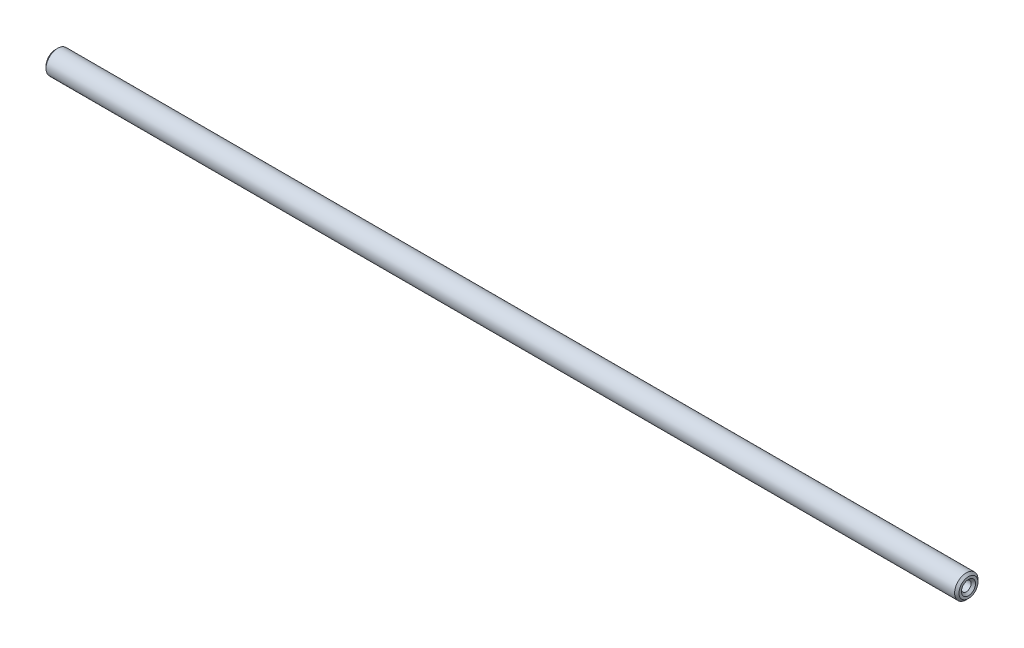
ISO-10303-21;
HEADER;
FILE_DESCRIPTION(('STEP AP214'),'2;1');
FILE_NAME('part.step','',(''),(''),'','','');
FILE_SCHEMA(('AUTOMOTIVE_DESIGN { 1 0 10303 214 1 1 1 1 }'));
ENDSEC;
DATA;
#1=APPLICATION_CONTEXT('core data for automotive mechanical design processes');
#2=APPLICATION_PROTOCOL_DEFINITION('international standard','automotive_design',2000,#1);
#3=PRODUCT_CONTEXT('',#1,'mechanical');
#4=PRODUCT('Part','Part','',(#3));
#5=PRODUCT_RELATED_PRODUCT_CATEGORY('part','',(#4));
#6=PRODUCT_DEFINITION_FORMATION('','',#4);
#7=PRODUCT_DEFINITION_CONTEXT('part definition',#1,'design');
#8=PRODUCT_DEFINITION('design','',#6,#7);
#9=PRODUCT_DEFINITION_SHAPE('','',#8);
#10=(LENGTH_UNIT() NAMED_UNIT(*) SI_UNIT(.MILLI.,.METRE.));
#11=(NAMED_UNIT(*) PLANE_ANGLE_UNIT() SI_UNIT($,.RADIAN.));
#12=(NAMED_UNIT(*) SI_UNIT($,.STERADIAN.) SOLID_ANGLE_UNIT());
#13=UNCERTAINTY_MEASURE_WITH_UNIT(LENGTH_MEASURE(1.E-05),#10,'distance_accuracy_value','');
#14=(GEOMETRIC_REPRESENTATION_CONTEXT(3) GLOBAL_UNCERTAINTY_ASSIGNED_CONTEXT((#13)) GLOBAL_UNIT_ASSIGNED_CONTEXT((#10,
#11,#12)) REPRESENTATION_CONTEXT('',''));
#15=CARTESIAN_POINT('',(0.,0.,0.));
#16=DIRECTION('',(0.,0.,1.));
#17=DIRECTION('',(1.,0.,0.));
#18=AXIS2_PLACEMENT_3D('',#15,#16,#17);
#19=CARTESIAN_POINT('',(156.,0.,0.));
#20=DIRECTION('',(-1.,0.,0.));
#21=DIRECTION('',(0.,0.,1.));
#22=AXIS2_PLACEMENT_3D('',#19,#20,#21);
#23=CYLINDRICAL_SURFACE('',#22,4.);
#24=CARTESIAN_POINT('',(155.25,0.,0.));
#25=DIRECTION('',(1.,0.,0.));
#26=DIRECTION('',(0.,0.,-1.));
#27=AXIS2_PLACEMENT_3D('',#24,#25,#26);
#28=CIRCLE('',#27,4.);
#29=CARTESIAN_POINT('',(155.25,0.,-4.));
#30=VERTEX_POINT('',#29);
#31=EDGE_CURVE('E293',#30,#30,#28,.F.);
#32=ORIENTED_EDGE('',*,*,#31,.T.);
#33=EDGE_LOOP('',(#32));
#34=FACE_BOUND('',#33,.T.);
#35=CARTESIAN_POINT('',(-155.25,0.,0.));
#36=DIRECTION('',(1.,0.,0.));
#37=DIRECTION('',(0.,0.,-1.));
#38=AXIS2_PLACEMENT_3D('',#35,#36,#37);
#39=CIRCLE('',#38,4.);
#40=CARTESIAN_POINT('',(-155.25,0.,-4.));
#41=VERTEX_POINT('',#40);
#42=EDGE_CURVE('E297',#41,#41,#39,.T.);
#43=ORIENTED_EDGE('',*,*,#42,.T.);
#44=EDGE_LOOP('',(#43));
#45=FACE_BOUND('',#44,.T.);
#46=ADVANCED_FACE('F281',(#34,#45),#23,.T.);
#47=CARTESIAN_POINT('',(156.,0.,0.));
#48=DIRECTION('',(1.,0.,0.));
#49=DIRECTION('',(0.,0.,-1.));
#50=AXIS2_PLACEMENT_3D('',#47,#48,#49);
#51=PLANE('',#50);
#52=CARTESIAN_POINT('',(156.,0.,0.));
#53=DIRECTION('',(1.,0.,0.));
#54=DIRECTION('',(0.,0.,-1.));
#55=AXIS2_PLACEMENT_3D('',#52,#53,#54);
#56=CIRCLE('',#55,2.39999999999993);
#57=CARTESIAN_POINT('',(156.,0.,-2.39999999999993));
#58=VERTEX_POINT('',#57);
#59=EDGE_CURVE('E308',#58,#58,#56,.F.);
#60=ORIENTED_EDGE('',*,*,#59,.T.);
#61=EDGE_LOOP('',(#60));
#62=FACE_BOUND('',#61,.T.);
#63=CARTESIAN_POINT('',(156.,0.,0.));
#64=DIRECTION('',(1.,0.,0.));
#65=DIRECTION('',(0.,0.,-1.));
#66=AXIS2_PLACEMENT_3D('',#63,#64,#65);
#67=CIRCLE('',#66,3.24999999999995);
#68=CARTESIAN_POINT('',(156.,0.,-3.24999999999995));
#69=VERTEX_POINT('',#68);
#70=EDGE_CURVE('E311',#69,#69,#67,.T.);
#71=ORIENTED_EDGE('',*,*,#70,.T.);
#72=EDGE_LOOP('',(#71));
#73=FACE_BOUND('',#72,.T.);
#74=ADVANCED_FACE('F315',(#62,#73),#51,.T.);
#75=CARTESIAN_POINT('',(-156.,0.,0.));
#76=DIRECTION('',(1.,0.,0.));
#77=DIRECTION('',(0.,0.,-1.));
#78=AXIS2_PLACEMENT_3D('',#75,#76,#77);
#79=PLANE('',#78);
#80=CARTESIAN_POINT('',(-156.,0.,0.));
#81=DIRECTION('',(1.,0.,0.));
#82=DIRECTION('',(0.,0.,-1.));
#83=AXIS2_PLACEMENT_3D('',#80,#81,#82);
#84=CIRCLE('',#83,2.40000000000004);
#85=CARTESIAN_POINT('',(-156.,0.,-2.40000000000004));
#86=VERTEX_POINT('',#85);
#87=EDGE_CURVE('E11',#86,#86,#84,.T.);
#88=ORIENTED_EDGE('',*,*,#87,.T.);
#89=EDGE_LOOP('',(#88));
#90=FACE_BOUND('',#89,.T.);
#91=CARTESIAN_POINT('',(-156.,0.,0.));
#92=DIRECTION('',(1.,0.,0.));
#93=DIRECTION('',(0.,0.,-1.));
#94=AXIS2_PLACEMENT_3D('',#91,#92,#93);
#95=CIRCLE('',#94,3.25000000000006);
#96=CARTESIAN_POINT('',(-156.,0.,-3.25000000000006));
#97=VERTEX_POINT('',#96);
#98=EDGE_CURVE('E289',#97,#97,#95,.F.);
#99=ORIENTED_EDGE('',*,*,#98,.T.);
#100=EDGE_LOOP('',(#99));
#101=FACE_BOUND('',#100,.T.);
#102=ADVANCED_FACE('F339',(#90,#101),#79,.F.);
#103=CARTESIAN_POINT('',(156.,0.,0.));
#104=DIRECTION('',(-1.,0.,0.));
#105=DIRECTION('',(0.,0.,1.));
#106=AXIS2_PLACEMENT_3D('',#103,#104,#105);
#107=CYLINDRICAL_SURFACE('',#106,1.65);
#108=CARTESIAN_POINT('',(155.25,0.,0.));
#109=DIRECTION('',(1.,0.,0.));
#110=DIRECTION('',(0.,0.,-1.));
#111=AXIS2_PLACEMENT_3D('',#108,#109,#110);
#112=CIRCLE('',#111,1.65);
#113=CARTESIAN_POINT('',(155.25,0.,-1.65));
#114=VERTEX_POINT('',#113);
#115=EDGE_CURVE('E302',#114,#114,#112,.T.);
#116=ORIENTED_EDGE('',*,*,#115,.T.);
#117=EDGE_LOOP('',(#116));
#118=FACE_BOUND('',#117,.T.);
#119=CARTESIAN_POINT('',(-155.25,0.,0.));
#120=DIRECTION('',(1.,0.,0.));
#121=DIRECTION('',(0.,0.,-1.));
#122=AXIS2_PLACEMENT_3D('',#119,#120,#121);
#123=CIRCLE('',#122,1.65);
#124=CARTESIAN_POINT('',(-155.25,0.,-1.65));
#125=VERTEX_POINT('',#124);
#126=EDGE_CURVE('E305',#125,#125,#123,.F.);
#127=ORIENTED_EDGE('',*,*,#126,.T.);
#128=EDGE_LOOP('',(#127));
#129=FACE_BOUND('',#128,.T.);
#130=ADVANCED_FACE('F328',(#118,#129),#107,.F.);
#131=CARTESIAN_POINT('',(156.,0.,0.));
#132=DIRECTION('',(1.,0.,0.));
#133=DIRECTION('',(0.,0.,-1.));
#134=AXIS2_PLACEMENT_3D('',#131,#132,#133);
#135=CONICAL_SURFACE('',#134,2.39999999999993,0.785398163397438);
#136=ORIENTED_EDGE('',*,*,#115,.F.);
#137=EDGE_LOOP('',(#136));
#138=FACE_BOUND('',#137,.T.);
#139=ORIENTED_EDGE('',*,*,#59,.F.);
#140=EDGE_LOOP('',(#139));
#141=FACE_BOUND('',#140,.T.);
#142=ADVANCED_FACE('F320',(#138,#141),#135,.F.);
#143=CARTESIAN_POINT('',(156.,0.,0.));
#144=DIRECTION('',(-1.,0.,0.));
#145=DIRECTION('',(0.,0.,1.));
#146=AXIS2_PLACEMENT_3D('',#143,#144,#145);
#147=CONICAL_SURFACE('',#146,3.24999999999995,0.785398163397446);
#148=ORIENTED_EDGE('',*,*,#31,.F.);
#149=EDGE_LOOP('',(#148));
#150=FACE_BOUND('',#149,.T.);
#151=ORIENTED_EDGE('',*,*,#70,.F.);
#152=EDGE_LOOP('',(#151));
#153=FACE_BOUND('',#152,.T.);
#154=ADVANCED_FACE('F317',(#150,#153),#147,.T.);
#155=CARTESIAN_POINT('',(-155.25,0.,0.));
#156=DIRECTION('',(-1.,0.,0.));
#157=DIRECTION('',(0.,0.,1.));
#158=AXIS2_PLACEMENT_3D('',#155,#156,#157);
#159=CONICAL_SURFACE('',#158,1.65,0.785398163397494);
#160=ORIENTED_EDGE('',*,*,#87,.F.);
#161=EDGE_LOOP('',(#160));
#162=FACE_BOUND('',#161,.T.);
#163=ORIENTED_EDGE('',*,*,#126,.F.);
#164=EDGE_LOOP('',(#163));
#165=FACE_BOUND('',#164,.T.);
#166=ADVANCED_FACE('F319',(#162,#165),#159,.F.);
#167=CARTESIAN_POINT('',(-155.25,0.,0.));
#168=DIRECTION('',(1.,0.,0.));
#169=DIRECTION('',(0.,0.,-1.));
#170=AXIS2_PLACEMENT_3D('',#167,#168,#169);
#171=CONICAL_SURFACE('',#170,4.,0.785398163397464);
#172=ORIENTED_EDGE('',*,*,#98,.F.);
#173=EDGE_LOOP('',(#172));
#174=FACE_BOUND('',#173,.T.);
#175=ORIENTED_EDGE('',*,*,#42,.F.);
#176=EDGE_LOOP('',(#175));
#177=FACE_BOUND('',#176,.T.);
#178=ADVANCED_FACE('F284',(#174,#177),#171,.T.);
#179=CLOSED_SHELL('',(#46,#74,#102,#130,#142,#154,#166,#178));
#180=MANIFOLD_SOLID_BREP('B2',#179);
#181=ADVANCED_BREP_SHAPE_REPRESENTATION('',(#18,#180),#14);
#182=SHAPE_DEFINITION_REPRESENTATION(#9,#181);
ENDSEC;
END-ISO-10303-21;
